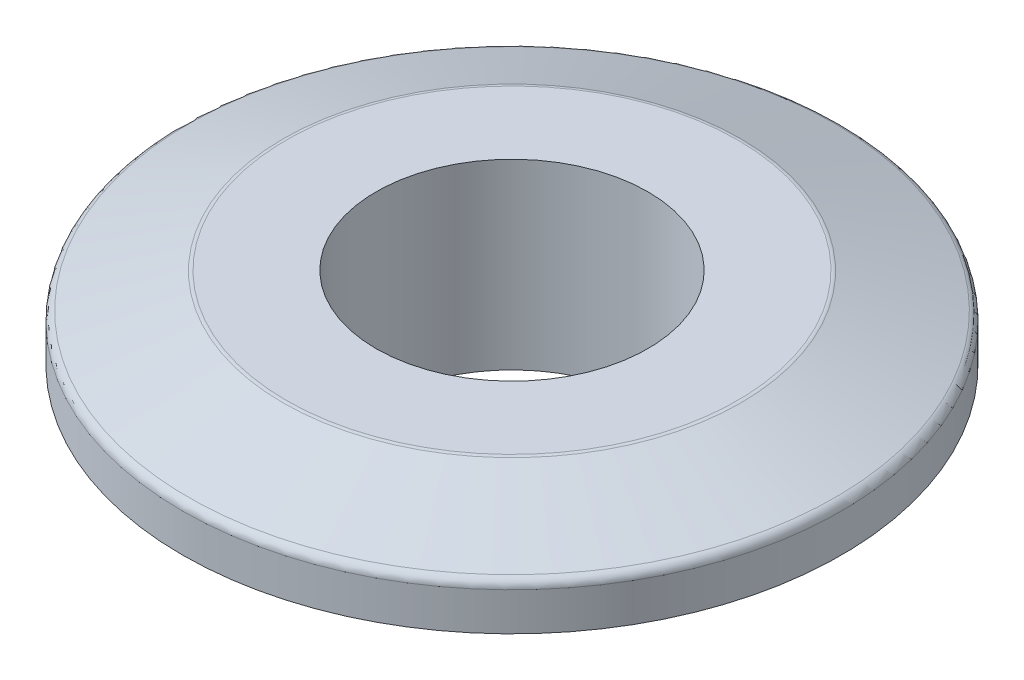
ISO-10303-21;
HEADER;
FILE_DESCRIPTION(('STEP AP214'),'2;1');
FILE_NAME('part.step','',(''),(''),'','','');
FILE_SCHEMA(('AUTOMOTIVE_DESIGN { 1 0 10303 214 1 1 1 1 }'));
ENDSEC;
DATA;
#1=APPLICATION_CONTEXT('core data for automotive mechanical design processes');
#2=APPLICATION_PROTOCOL_DEFINITION('international standard','automotive_design',2000,#1);
#3=PRODUCT_CONTEXT('',#1,'mechanical');
#4=PRODUCT('Part','Part','',(#3));
#5=PRODUCT_RELATED_PRODUCT_CATEGORY('part','',(#4));
#6=PRODUCT_DEFINITION_FORMATION('','',#4);
#7=PRODUCT_DEFINITION_CONTEXT('part definition',#1,'design');
#8=PRODUCT_DEFINITION('design','',#6,#7);
#9=PRODUCT_DEFINITION_SHAPE('','',#8);
#10=(LENGTH_UNIT() NAMED_UNIT(*) SI_UNIT(.MILLI.,.METRE.));
#11=(NAMED_UNIT(*) PLANE_ANGLE_UNIT() SI_UNIT($,.RADIAN.));
#12=(NAMED_UNIT(*) SI_UNIT($,.STERADIAN.) SOLID_ANGLE_UNIT());
#13=UNCERTAINTY_MEASURE_WITH_UNIT(LENGTH_MEASURE(1.E-05),#10,'distance_accuracy_value','');
#14=(GEOMETRIC_REPRESENTATION_CONTEXT(3) GLOBAL_UNCERTAINTY_ASSIGNED_CONTEXT((#13)) GLOBAL_UNIT_ASSIGNED_CONTEXT((#10,
#11,#12)) REPRESENTATION_CONTEXT('',''));
#15=CARTESIAN_POINT('',(0.,0.,0.));
#16=DIRECTION('',(0.,0.,1.));
#17=DIRECTION('',(1.,0.,0.));
#18=AXIS2_PLACEMENT_3D('',#15,#16,#17);
#19=CARTESIAN_POINT('',(0.,0.,0.));
#20=DIRECTION('',(0.,1.,0.));
#21=DIRECTION('',(0.,0.,1.));
#22=AXIS2_PLACEMENT_3D('',#19,#20,#21);
#23=PLANE('',#22);
#24=CARTESIAN_POINT('',(0.,0.,0.));
#25=DIRECTION('',(0.,1.,0.));
#26=DIRECTION('',(0.,0.,1.));
#27=AXIS2_PLACEMENT_3D('',#24,#25,#26);
#28=CIRCLE('',#27,12.065);
#29=CARTESIAN_POINT('',(0.,0.,12.065));
#30=VERTEX_POINT('',#29);
#31=EDGE_CURVE('E65',#30,#30,#28,.F.);
#32=ORIENTED_EDGE('',*,*,#31,.T.);
#33=EDGE_LOOP('',(#32));
#34=FACE_BOUND('',#33,.T.);
#35=CARTESIAN_POINT('',(0.,0.,0.));
#36=DIRECTION('',(0.,1.,0.));
#37=DIRECTION('',(0.,0.,1.));
#38=AXIS2_PLACEMENT_3D('',#35,#36,#37);
#39=CIRCLE('',#38,9.271);
#40=CARTESIAN_POINT('',(0.,0.,9.271));
#41=VERTEX_POINT('',#40);
#42=EDGE_CURVE('E70',#41,#41,#39,.T.);
#43=ORIENTED_EDGE('',*,*,#42,.T.);
#44=EDGE_LOOP('',(#43));
#45=FACE_BOUND('',#44,.T.);
#46=ADVANCED_FACE('F36',(#34,#45),#23,.F.);
#47=CARTESIAN_POINT('',(0.,12.446,0.));
#48=DIRECTION('',(0.,-1.,0.));
#49=DIRECTION('',(0.,0.,-1.));
#50=AXIS2_PLACEMENT_3D('',#47,#48,#49);
#51=CYLINDRICAL_SURFACE('',#50,22.479);
#52=CARTESIAN_POINT('',(0.,9.46136821323683,0.));
#53=DIRECTION('',(0.,1.,0.));
#54=DIRECTION('',(0.,0.,1.));
#55=AXIS2_PLACEMENT_3D('',#52,#53,#54);
#56=CIRCLE('',#55,22.479);
#57=CARTESIAN_POINT('',(0.,9.46136821323683,22.479));
#58=VERTEX_POINT('',#57);
#59=EDGE_CURVE('E10',#58,#58,#56,.F.);
#60=ORIENTED_EDGE('',*,*,#59,.T.);
#61=EDGE_LOOP('',(#60));
#62=FACE_BOUND('',#61,.T.);
#63=CARTESIAN_POINT('',(0.,6.858,0.));
#64=DIRECTION('',(0.,-1.,0.));
#65=DIRECTION('',(0.,0.,-1.));
#66=AXIS2_PLACEMENT_3D('',#63,#64,#65);
#67=CIRCLE('',#66,22.479);
#68=CARTESIAN_POINT('',(0.,6.858,-22.479));
#69=VERTEX_POINT('',#68);
#70=EDGE_CURVE('E74',#69,#69,#67,.T.);
#71=ORIENTED_EDGE('',*,*,#70,.F.);
#72=EDGE_LOOP('',(#71));
#73=FACE_BOUND('',#72,.T.);
#74=ADVANCED_FACE('F94',(#62,#73),#51,.T.);
#75=CARTESIAN_POINT('',(0.,12.446,0.));
#76=DIRECTION('',(0.,1.,0.));
#77=DIRECTION('',(0.,0.,1.));
#78=AXIS2_PLACEMENT_3D('',#75,#76,#77);
#79=PLANE('',#78);
#80=CARTESIAN_POINT('',(0.,12.446,0.));
#81=DIRECTION('',(0.,1.,0.));
#82=DIRECTION('',(0.,0.,1.));
#83=AXIS2_PLACEMENT_3D('',#80,#81,#82);
#84=CIRCLE('',#83,15.3884397218354);
#85=CARTESIAN_POINT('',(0.,12.446,15.3884397218354));
#86=VERTEX_POINT('',#85);
#87=EDGE_CURVE('E56',#86,#86,#84,.T.);
#88=ORIENTED_EDGE('',*,*,#87,.T.);
#89=EDGE_LOOP('',(#88));
#90=FACE_BOUND('',#89,.T.);
#91=CARTESIAN_POINT('',(0.,12.446,0.));
#92=DIRECTION('',(0.,1.,0.));
#93=DIRECTION('',(0.,0.,1.));
#94=AXIS2_PLACEMENT_3D('',#91,#92,#93);
#95=CIRCLE('',#94,9.271);
#96=CARTESIAN_POINT('',(0.,12.446,9.271));
#97=VERTEX_POINT('',#96);
#98=EDGE_CURVE('E69',#97,#97,#95,.T.);
#99=ORIENTED_EDGE('',*,*,#98,.F.);
#100=EDGE_LOOP('',(#99));
#101=FACE_BOUND('',#100,.T.);
#102=ADVANCED_FACE('F96',(#90,#101),#79,.T.);
#103=CARTESIAN_POINT('',(0.,12.446,0.));
#104=DIRECTION('',(0.,-1.,0.));
#105=DIRECTION('',(0.,0.,-1.));
#106=AXIS2_PLACEMENT_3D('',#103,#104,#105);
#107=CYLINDRICAL_SURFACE('',#106,9.271);
#108=ORIENTED_EDGE('',*,*,#98,.T.);
#109=EDGE_LOOP('',(#108));
#110=FACE_BOUND('',#109,.T.);
#111=ORIENTED_EDGE('',*,*,#42,.F.);
#112=EDGE_LOOP('',(#111));
#113=FACE_BOUND('',#112,.T.);
#114=ADVANCED_FACE('F90',(#110,#113),#107,.F.);
#115=CARTESIAN_POINT('',(0.,6.858,0.));
#116=DIRECTION('',(0.,-1.,0.));
#117=DIRECTION('',(0.,0.,-1.));
#118=AXIS2_PLACEMENT_3D('',#115,#116,#117);
#119=PLANE('',#118);
#120=CARTESIAN_POINT('',(0.,6.858,0.));
#121=DIRECTION('',(0.,-1.,0.));
#122=DIRECTION('',(0.,0.,-1.));
#123=AXIS2_PLACEMENT_3D('',#120,#121,#122);
#124=CIRCLE('',#123,12.7);
#125=CARTESIAN_POINT('',(0.,6.858,-12.7));
#126=VERTEX_POINT('',#125);
#127=EDGE_CURVE('E80',#126,#126,#124,.T.);
#128=ORIENTED_EDGE('',*,*,#127,.F.);
#129=EDGE_LOOP('',(#128));
#130=FACE_BOUND('',#129,.T.);
#131=ORIENTED_EDGE('',*,*,#70,.T.);
#132=EDGE_LOOP('',(#131));
#133=FACE_BOUND('',#132,.T.);
#134=ADVANCED_FACE('F87',(#130,#133),#119,.T.);
#135=CARTESIAN_POINT('',(0.,6.858,0.));
#136=DIRECTION('',(0.,-1.,0.));
#137=DIRECTION('',(0.,0.,-1.));
#138=AXIS2_PLACEMENT_3D('',#135,#136,#137);
#139=CYLINDRICAL_SURFACE('',#138,12.7);
#140=CARTESIAN_POINT('',(0.,0.634999999999988,0.));
#141=DIRECTION('',(0.,1.,0.));
#142=DIRECTION('',(0.,0.,1.));
#143=AXIS2_PLACEMENT_3D('',#140,#141,#142);
#144=CIRCLE('',#143,12.7);
#145=CARTESIAN_POINT('',(0.,0.634999999999988,12.7));
#146=VERTEX_POINT('',#145);
#147=EDGE_CURVE('E61',#146,#146,#144,.T.);
#148=ORIENTED_EDGE('',*,*,#147,.T.);
#149=EDGE_LOOP('',(#148));
#150=FACE_BOUND('',#149,.T.);
#151=ORIENTED_EDGE('',*,*,#127,.T.);
#152=EDGE_LOOP('',(#151));
#153=FACE_BOUND('',#152,.T.);
#154=ADVANCED_FACE('F85',(#150,#153),#139,.T.);
#155=CARTESIAN_POINT('',(0.,12.446,0.));
#156=DIRECTION('',(0.,-1.,0.));
#157=DIRECTION('',(0.,0.,-1.));
#158=AXIS2_PLACEMENT_3D('',#155,#156,#157);
#159=CONICAL_SURFACE('',#158,15.5004073545853,1.22173047639603);
#160=CARTESIAN_POINT('',(0.,12.4077048141991,0.));
#161=DIRECTION('',(0.,1.,0.));
#162=DIRECTION('',(0.,0.,1.));
#163=AXIS2_PLACEMENT_3D('',#160,#161,#162);
#164=CIRCLE('',#163,15.6056225128472);
#165=CARTESIAN_POINT('',(0.,12.4077048141991,15.6056225128472));
#166=VERTEX_POINT('',#165);
#167=EDGE_CURVE('E44',#166,#166,#164,.F.);
#168=ORIENTED_EDGE('',*,*,#167,.T.);
#169=EDGE_LOOP('',(#168));
#170=FACE_BOUND('',#169,.T.);
#171=CARTESIAN_POINT('',(0.,10.0580730274359,0.));
#172=DIRECTION('',(0.,-1.,0.));
#173=DIRECTION('',(0.,0.,-1.));
#174=AXIS2_PLACEMENT_3D('',#171,#172,#173);
#175=CIRCLE('',#174,22.0611827910118);
#176=CARTESIAN_POINT('',(0.,10.0580730274359,-22.0611827910118));
#177=VERTEX_POINT('',#176);
#178=EDGE_CURVE('E51',#177,#177,#175,.F.);
#179=ORIENTED_EDGE('',*,*,#178,.T.);
#180=EDGE_LOOP('',(#179));
#181=FACE_BOUND('',#180,.T.);
#182=ADVANCED_FACE('F107',(#170,#181),#159,.T.);
#183=CARTESIAN_POINT('',(0.,0.,0.));
#184=DIRECTION('',(0.,1.,0.));
#185=DIRECTION('',(0.,0.,1.));
#186=AXIS2_PLACEMENT_3D('',#183,#184,#185);
#187=CONICAL_SURFACE('',#186,12.065,0.785398163397452);
#188=ORIENTED_EDGE('',*,*,#147,.F.);
#189=EDGE_LOOP('',(#188));
#190=FACE_BOUND('',#189,.T.);
#191=ORIENTED_EDGE('',*,*,#31,.F.);
#192=EDGE_LOOP('',(#191));
#193=FACE_BOUND('',#192,.T.);
#194=ADVANCED_FACE('F110',(#190,#193),#187,.T.);
#195=CARTESIAN_POINT('',(0.,11.811,0.));
#196=DIRECTION('',(0.,1.,0.));
#197=DIRECTION('',(0.,0.,1.));
#198=AXIS2_PLACEMENT_3D('',#195,#196,#197);
#199=TOROIDAL_SURFACE('',#198,15.3884397218354,0.635);
#200=ORIENTED_EDGE('',*,*,#167,.F.);
#201=EDGE_LOOP('',(#200));
#202=FACE_BOUND('',#201,.T.);
#203=ORIENTED_EDGE('',*,*,#87,.F.);
#204=EDGE_LOOP('',(#203));
#205=FACE_BOUND('',#204,.T.);
#206=ADVANCED_FACE('F112',(#202,#205),#199,.T.);
#207=CARTESIAN_POINT('',(0.,9.46136821323683,0.));
#208=DIRECTION('',(0.,1.,0.));
#209=DIRECTION('',(0.,0.,1.));
#210=AXIS2_PLACEMENT_3D('',#207,#208,#209);
#211=TOROIDAL_SURFACE('',#210,21.844,0.635);
#212=ORIENTED_EDGE('',*,*,#178,.F.);
#213=EDGE_LOOP('',(#212));
#214=FACE_BOUND('',#213,.T.);
#215=ORIENTED_EDGE('',*,*,#59,.F.);
#216=EDGE_LOOP('',(#215));
#217=FACE_BOUND('',#216,.T.);
#218=ADVANCED_FACE('F38',(#214,#217),#211,.T.);
#219=CLOSED_SHELL('',(#46,#74,#102,#114,#134,#154,#182,#194,#206,#218));
#220=MANIFOLD_SOLID_BREP('B2',#219);
#221=ADVANCED_BREP_SHAPE_REPRESENTATION('',(#18,#220),#14);
#222=SHAPE_DEFINITION_REPRESENTATION(#9,#221);
ENDSEC;
END-ISO-10303-21;
